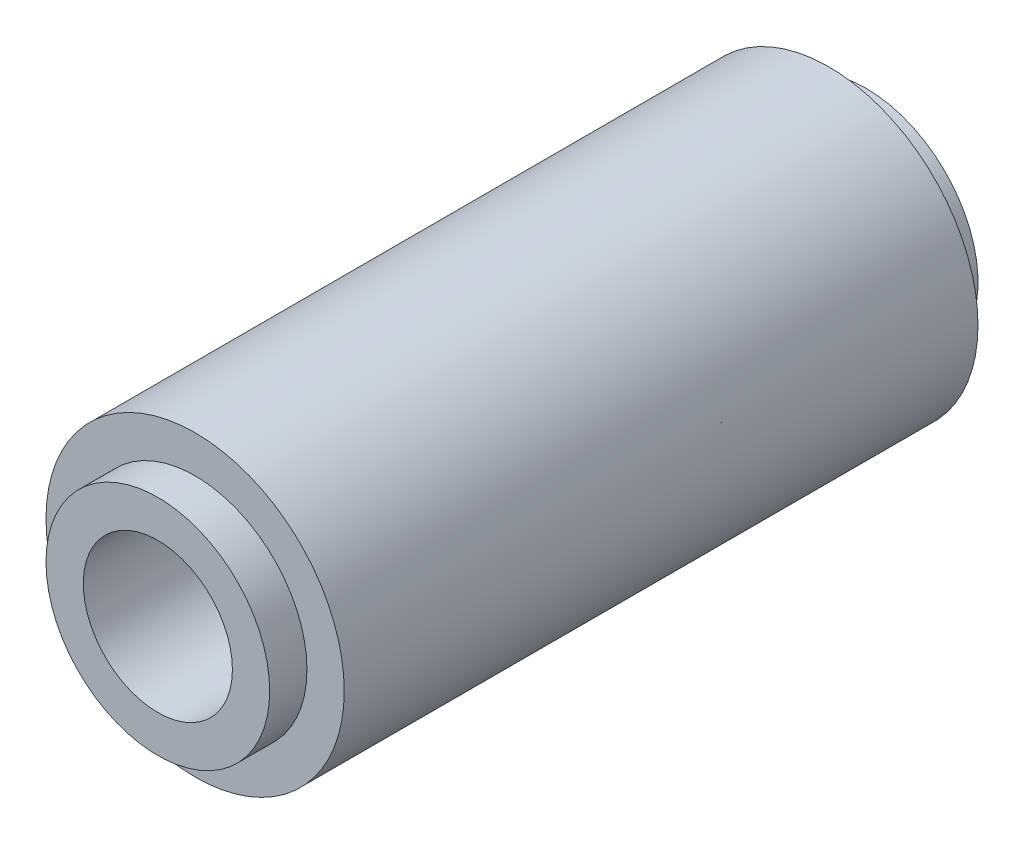
ISO-10303-21;
HEADER;
FILE_DESCRIPTION(('STEP AP214'),'2;1');
FILE_NAME('part.step','',(''),(''),'','','');
FILE_SCHEMA(('AUTOMOTIVE_DESIGN { 1 0 10303 214 1 1 1 1 }'));
ENDSEC;
DATA;
#1=APPLICATION_CONTEXT('core data for automotive mechanical design processes');
#2=APPLICATION_PROTOCOL_DEFINITION('international standard','automotive_design',2000,#1);
#3=PRODUCT_CONTEXT('',#1,'mechanical');
#4=PRODUCT('Part','Part','',(#3));
#5=PRODUCT_RELATED_PRODUCT_CATEGORY('part','',(#4));
#6=PRODUCT_DEFINITION_FORMATION('','',#4);
#7=PRODUCT_DEFINITION_CONTEXT('part definition',#1,'design');
#8=PRODUCT_DEFINITION('design','',#6,#7);
#9=PRODUCT_DEFINITION_SHAPE('','',#8);
#10=(LENGTH_UNIT() NAMED_UNIT(*) SI_UNIT(.MILLI.,.METRE.));
#11=(NAMED_UNIT(*) PLANE_ANGLE_UNIT() SI_UNIT($,.RADIAN.));
#12=(NAMED_UNIT(*) SI_UNIT($,.STERADIAN.) SOLID_ANGLE_UNIT());
#13=UNCERTAINTY_MEASURE_WITH_UNIT(LENGTH_MEASURE(1.E-05),#10,'distance_accuracy_value','');
#14=(GEOMETRIC_REPRESENTATION_CONTEXT(3) GLOBAL_UNCERTAINTY_ASSIGNED_CONTEXT((#13)) GLOBAL_UNIT_ASSIGNED_CONTEXT((#10,
#11,#12)) REPRESENTATION_CONTEXT('',''));
#15=CARTESIAN_POINT('',(0.,0.,0.));
#16=DIRECTION('',(0.,0.,1.));
#17=DIRECTION('',(1.,0.,0.));
#18=AXIS2_PLACEMENT_3D('',#15,#16,#17);
#19=CARTESIAN_POINT('',(0.,0.,-15.08125));
#20=DIRECTION('',(0.,0.,-1.));
#21=DIRECTION('',(0.,-1.,0.));
#22=AXIS2_PLACEMENT_3D('',#19,#20,#21);
#23=CYLINDRICAL_SURFACE('',#22,4.7625);
#24=CARTESIAN_POINT('',(0.,0.,-13.49375));
#25=DIRECTION('',(0.,0.,1.));
#26=DIRECTION('',(1.,0.,0.));
#27=AXIS2_PLACEMENT_3D('',#24,#25,#26);
#28=CIRCLE('',#27,4.7625);
#29=CARTESIAN_POINT('',(4.7625,0.,-13.49375));
#30=VERTEX_POINT('',#29);
#31=EDGE_CURVE('E8',#30,#30,#28,.T.);
#32=ORIENTED_EDGE('',*,*,#31,.F.);
#33=EDGE_LOOP('',(#32));
#34=FACE_BOUND('',#33,.T.);
#35=CARTESIAN_POINT('',(0.,0.,-15.08125));
#36=DIRECTION('',(0.,0.,-1.));
#37=DIRECTION('',(0.,-1.,0.));
#38=AXIS2_PLACEMENT_3D('',#35,#36,#37);
#39=CIRCLE('',#38,4.7625);
#40=CARTESIAN_POINT('',(0.,-4.7625,-15.08125));
#41=VERTEX_POINT('',#40);
#42=EDGE_CURVE('E26',#41,#41,#39,.T.);
#43=ORIENTED_EDGE('',*,*,#42,.F.);
#44=EDGE_LOOP('',(#43));
#45=FACE_BOUND('',#44,.T.);
#46=ADVANCED_FACE('F13',(#34,#45),#23,.T.);
#47=CARTESIAN_POINT('',(0.,0.,-13.49375));
#48=DIRECTION('',(0.,0.,1.));
#49=DIRECTION('',(1.,0.,0.));
#50=AXIS2_PLACEMENT_3D('',#47,#48,#49);
#51=PLANE('',#50);
#52=ORIENTED_EDGE('',*,*,#31,.T.);
#53=EDGE_LOOP('',(#52));
#54=FACE_BOUND('',#53,.T.);
#55=CARTESIAN_POINT('',(0.,0.,-13.49375));
#56=DIRECTION('',(0.,0.,1.));
#57=DIRECTION('',(1.,0.,0.));
#58=AXIS2_PLACEMENT_3D('',#55,#56,#57);
#59=CIRCLE('',#58,6.35);
#60=CARTESIAN_POINT('',(6.35,0.,-13.49375));
#61=VERTEX_POINT('',#60);
#62=EDGE_CURVE('E32',#61,#61,#59,.T.);
#63=ORIENTED_EDGE('',*,*,#62,.F.);
#64=EDGE_LOOP('',(#63));
#65=FACE_BOUND('',#64,.T.);
#66=ADVANCED_FACE('F64',(#54,#65),#51,.F.);
#67=CARTESIAN_POINT('',(0.,0.,15.08125));
#68=DIRECTION('',(0.,0.,-1.));
#69=DIRECTION('',(0.,-1.,0.));
#70=AXIS2_PLACEMENT_3D('',#67,#68,#69);
#71=CYLINDRICAL_SURFACE('',#70,4.7625);
#72=CARTESIAN_POINT('',(0.,0.,13.49375));
#73=DIRECTION('',(0.,0.,1.));
#74=DIRECTION('',(1.,0.,0.));
#75=AXIS2_PLACEMENT_3D('',#72,#73,#74);
#76=CIRCLE('',#75,4.7625);
#77=CARTESIAN_POINT('',(4.7625,0.,13.49375));
#78=VERTEX_POINT('',#77);
#79=EDGE_CURVE('E21',#78,#78,#76,.T.);
#80=ORIENTED_EDGE('',*,*,#79,.T.);
#81=EDGE_LOOP('',(#80));
#82=FACE_BOUND('',#81,.T.);
#83=CARTESIAN_POINT('',(0.,0.,15.08125));
#84=DIRECTION('',(0.,0.,1.));
#85=DIRECTION('',(1.,0.,0.));
#86=AXIS2_PLACEMENT_3D('',#83,#84,#85);
#87=CIRCLE('',#86,4.7625);
#88=CARTESIAN_POINT('',(4.7625,0.,15.08125));
#89=VERTEX_POINT('',#88);
#90=EDGE_CURVE('E36',#89,#89,#87,.T.);
#91=ORIENTED_EDGE('',*,*,#90,.F.);
#92=EDGE_LOOP('',(#91));
#93=FACE_BOUND('',#92,.T.);
#94=ADVANCED_FACE('F70',(#82,#93),#71,.T.);
#95=CARTESIAN_POINT('',(0.,0.,13.49375));
#96=DIRECTION('',(0.,0.,-1.));
#97=DIRECTION('',(-1.,0.,0.));
#98=AXIS2_PLACEMENT_3D('',#95,#96,#97);
#99=PLANE('',#98);
#100=ORIENTED_EDGE('',*,*,#79,.F.);
#101=EDGE_LOOP('',(#100));
#102=FACE_BOUND('',#101,.T.);
#103=CARTESIAN_POINT('',(0.,0.,13.49375));
#104=DIRECTION('',(0.,0.,-1.));
#105=DIRECTION('',(0.,-1.,0.));
#106=AXIS2_PLACEMENT_3D('',#103,#104,#105);
#107=CIRCLE('',#106,6.35);
#108=CARTESIAN_POINT('',(0.,-6.35,13.49375));
#109=VERTEX_POINT('',#108);
#110=EDGE_CURVE('E34',#109,#109,#107,.T.);
#111=ORIENTED_EDGE('',*,*,#110,.F.);
#112=EDGE_LOOP('',(#111));
#113=FACE_BOUND('',#112,.T.);
#114=ADVANCED_FACE('F48',(#102,#113),#99,.F.);
#115=CARTESIAN_POINT('',(0.,0.,0.));
#116=DIRECTION('',(0.,0.,1.));
#117=DIRECTION('',(1.,0.,0.));
#118=AXIS2_PLACEMENT_3D('',#115,#116,#117);
#119=CYLINDRICAL_SURFACE('',#118,3.175);
#120=CARTESIAN_POINT('',(0.,0.,-15.08125));
#121=DIRECTION('',(0.,0.,1.));
#122=DIRECTION('',(1.,0.,0.));
#123=AXIS2_PLACEMENT_3D('',#120,#121,#122);
#124=CIRCLE('',#123,3.175);
#125=CARTESIAN_POINT('',(3.175,0.,-15.08125));
#126=VERTEX_POINT('',#125);
#127=EDGE_CURVE('E31',#126,#126,#124,.T.);
#128=ORIENTED_EDGE('',*,*,#127,.F.);
#129=EDGE_LOOP('',(#128));
#130=FACE_BOUND('',#129,.T.);
#131=CARTESIAN_POINT('',(0.,0.,15.08125));
#132=DIRECTION('',(0.,0.,-1.));
#133=DIRECTION('',(0.,-1.,0.));
#134=AXIS2_PLACEMENT_3D('',#131,#132,#133);
#135=CIRCLE('',#134,3.175);
#136=CARTESIAN_POINT('',(0.,-3.175,15.08125));
#137=VERTEX_POINT('',#136);
#138=EDGE_CURVE('E17',#137,#137,#135,.T.);
#139=ORIENTED_EDGE('',*,*,#138,.F.);
#140=EDGE_LOOP('',(#139));
#141=FACE_BOUND('',#140,.T.);
#142=ADVANCED_FACE('F45',(#130,#141),#119,.F.);
#143=CARTESIAN_POINT('',(0.,0.,-15.08125));
#144=DIRECTION('',(0.,0.,-1.));
#145=DIRECTION('',(-1.,0.,0.));
#146=AXIS2_PLACEMENT_3D('',#143,#144,#145);
#147=PLANE('',#146);
#148=ORIENTED_EDGE('',*,*,#42,.T.);
#149=EDGE_LOOP('',(#148));
#150=FACE_BOUND('',#149,.T.);
#151=ORIENTED_EDGE('',*,*,#127,.T.);
#152=EDGE_LOOP('',(#151));
#153=FACE_BOUND('',#152,.T.);
#154=ADVANCED_FACE('F43',(#150,#153),#147,.T.);
#155=CARTESIAN_POINT('',(0.,0.,0.));
#156=DIRECTION('',(0.,0.,1.));
#157=DIRECTION('',(1.,0.,0.));
#158=AXIS2_PLACEMENT_3D('',#155,#156,#157);
#159=CYLINDRICAL_SURFACE('',#158,6.35);
#160=ORIENTED_EDGE('',*,*,#62,.T.);
#161=EDGE_LOOP('',(#160));
#162=FACE_BOUND('',#161,.T.);
#163=ORIENTED_EDGE('',*,*,#110,.T.);
#164=EDGE_LOOP('',(#163));
#165=FACE_BOUND('',#164,.T.);
#166=ADVANCED_FACE('F15',(#162,#165),#159,.T.);
#167=CARTESIAN_POINT('',(0.,0.,15.08125));
#168=DIRECTION('',(0.,0.,-1.));
#169=DIRECTION('',(-1.,0.,0.));
#170=AXIS2_PLACEMENT_3D('',#167,#168,#169);
#171=PLANE('',#170);
#172=ORIENTED_EDGE('',*,*,#90,.T.);
#173=EDGE_LOOP('',(#172));
#174=FACE_BOUND('',#173,.T.);
#175=ORIENTED_EDGE('',*,*,#138,.T.);
#176=EDGE_LOOP('',(#175));
#177=FACE_BOUND('',#176,.T.);
#178=ADVANCED_FACE('F52',(#174,#177),#171,.F.);
#179=CLOSED_SHELL('',(#46,#66,#94,#114,#142,#154,#166,#178));
#180=MANIFOLD_SOLID_BREP('B1',#179);
#181=ADVANCED_BREP_SHAPE_REPRESENTATION('',(#18,#180),#14);
#182=SHAPE_DEFINITION_REPRESENTATION(#9,#181);
ENDSEC;
END-ISO-10303-21;
